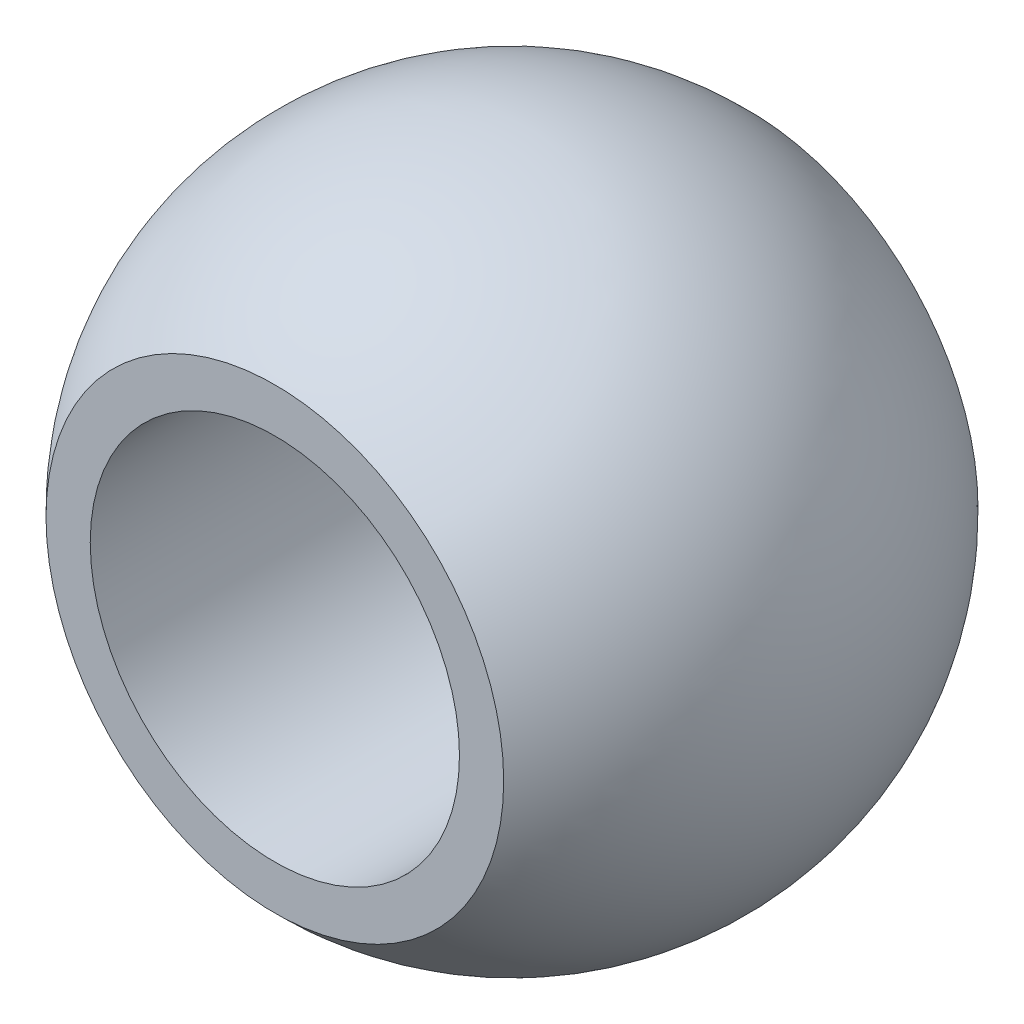
ISO-10303-21;
HEADER;
FILE_DESCRIPTION(('STEP AP214'),'2;1');
FILE_NAME('part.step','',(''),(''),'','','');
FILE_SCHEMA(('AUTOMOTIVE_DESIGN { 1 0 10303 214 1 1 1 1 }'));
ENDSEC;
DATA;
#1=APPLICATION_CONTEXT('core data for automotive mechanical design processes');
#2=APPLICATION_PROTOCOL_DEFINITION('international standard','automotive_design',2000,#1);
#3=PRODUCT_CONTEXT('',#1,'mechanical');
#4=PRODUCT('Part','Part','',(#3));
#5=PRODUCT_RELATED_PRODUCT_CATEGORY('part','',(#4));
#6=PRODUCT_DEFINITION_FORMATION('','',#4);
#7=PRODUCT_DEFINITION_CONTEXT('part definition',#1,'design');
#8=PRODUCT_DEFINITION('design','',#6,#7);
#9=PRODUCT_DEFINITION_SHAPE('','',#8);
#10=(LENGTH_UNIT() NAMED_UNIT(*) SI_UNIT(.MILLI.,.METRE.));
#11=(NAMED_UNIT(*) PLANE_ANGLE_UNIT() SI_UNIT($,.RADIAN.));
#12=(NAMED_UNIT(*) SI_UNIT($,.STERADIAN.) SOLID_ANGLE_UNIT());
#13=UNCERTAINTY_MEASURE_WITH_UNIT(LENGTH_MEASURE(1.E-05),#10,'distance_accuracy_value','');
#14=(GEOMETRIC_REPRESENTATION_CONTEXT(3) GLOBAL_UNCERTAINTY_ASSIGNED_CONTEXT((#13)) GLOBAL_UNIT_ASSIGNED_CONTEXT((#10,
#11,#12)) REPRESENTATION_CONTEXT('',''));
#15=CARTESIAN_POINT('',(0.,0.,0.));
#16=DIRECTION('',(0.,0.,1.));
#17=DIRECTION('',(1.,0.,0.));
#18=AXIS2_PLACEMENT_3D('',#15,#16,#17);
#19=CARTESIAN_POINT('',(0.,0.,-9.9187));
#20=DIRECTION('',(0.,0.,1.));
#21=DIRECTION('',(1.,0.,0.));
#22=AXIS2_PLACEMENT_3D('',#19,#20,#21);
#23=CYLINDRICAL_SURFACE('',#22,5.55625);
#24=CARTESIAN_POINT('',(0.,0.,-7.1374));
#25=DIRECTION('',(0.,0.,-1.));
#26=DIRECTION('',(-1.,0.,0.));
#27=AXIS2_PLACEMENT_3D('',#24,#25,#26);
#28=CIRCLE('',#27,5.55625);
#29=CARTESIAN_POINT('',(-5.55625,0.,-7.1374));
#30=VERTEX_POINT('',#29);
#31=EDGE_CURVE('E45',#30,#30,#28,.F.);
#32=ORIENTED_EDGE('',*,*,#31,.F.);
#33=EDGE_LOOP('',(#32));
#34=FACE_BOUND('',#33,.T.);
#35=CARTESIAN_POINT('',(0.,0.,7.1374));
#36=DIRECTION('',(0.,0.,1.));
#37=DIRECTION('',(1.,0.,0.));
#38=AXIS2_PLACEMENT_3D('',#35,#36,#37);
#39=CIRCLE('',#38,5.55625);
#40=CARTESIAN_POINT('',(5.55625,0.,7.1374));
#41=VERTEX_POINT('',#40);
#42=EDGE_CURVE('E35',#41,#41,#39,.F.);
#43=ORIENTED_EDGE('',*,*,#42,.F.);
#44=EDGE_LOOP('',(#43));
#45=FACE_BOUND('',#44,.T.);
#46=ADVANCED_FACE('F31',(#34,#45),#23,.F.);
#47=CARTESIAN_POINT('',(-19.9993358361775,-9.9187,-7.1374));
#48=DIRECTION('',(0.,0.,-1.));
#49=DIRECTION('',(-1.,0.,0.));
#50=AXIS2_PLACEMENT_3D('',#47,#48,#49);
#51=PLANE('',#50);
#52=ORIENTED_EDGE('',*,*,#31,.T.);
#53=EDGE_LOOP('',(#52));
#54=FACE_BOUND('',#53,.T.);
#55=CARTESIAN_POINT('',(0.,0.,-7.1374));
#56=DIRECTION('',(0.,0.,-1.));
#57=DIRECTION('',(-1.,0.,0.));
#58=AXIS2_PLACEMENT_3D('',#55,#56,#57);
#59=CIRCLE('',#58,6.88753445944193);
#60=CARTESIAN_POINT('',(-6.88753445944193,0.,-7.1374));
#61=VERTEX_POINT('',#60);
#62=EDGE_CURVE('E43',#61,#61,#59,.T.);
#63=ORIENTED_EDGE('',*,*,#62,.T.);
#64=EDGE_LOOP('',(#63));
#65=FACE_BOUND('',#64,.T.);
#66=ADVANCED_FACE('F52',(#54,#65),#51,.T.);
#67=CARTESIAN_POINT('',(-19.9993358361775,-9.9187,7.1374));
#68=DIRECTION('',(0.,0.,1.));
#69=DIRECTION('',(1.,0.,0.));
#70=AXIS2_PLACEMENT_3D('',#67,#68,#69);
#71=PLANE('',#70);
#72=ORIENTED_EDGE('',*,*,#42,.T.);
#73=EDGE_LOOP('',(#72));
#74=FACE_BOUND('',#73,.T.);
#75=CARTESIAN_POINT('',(0.,0.,7.1374));
#76=DIRECTION('',(0.,0.,1.));
#77=DIRECTION('',(1.,0.,0.));
#78=AXIS2_PLACEMENT_3D('',#75,#76,#77);
#79=CIRCLE('',#78,6.88753445944193);
#80=CARTESIAN_POINT('',(6.88753445944193,0.,7.1374));
#81=VERTEX_POINT('',#80);
#82=EDGE_CURVE('E11',#81,#81,#79,.T.);
#83=ORIENTED_EDGE('',*,*,#82,.T.);
#84=EDGE_LOOP('',(#83));
#85=FACE_BOUND('',#84,.T.);
#86=ADVANCED_FACE('F56',(#74,#85),#71,.T.);
#87=CARTESIAN_POINT('',(0.,0.,0.));
#88=DIRECTION('',(0.,1.,0.));
#89=DIRECTION('',(-1.,0.,0.));
#90=AXIS2_PLACEMENT_3D('',#87,#88,#89);
#91=SPHERICAL_SURFACE('',#90,9.9187);
#92=CARTESIAN_POINT('',(0.,0.,0.));
#93=DIRECTION('',(0.,0.,-1.));
#94=DIRECTION('',(-1.,0.,0.));
#95=AXIS2_PLACEMENT_3D('',#92,#93,#94);
#96=SPHERICAL_SURFACE('',#95,9.9187);
#97=ORIENTED_EDGE('',*,*,#62,.F.);
#98=EDGE_LOOP('',(#97));
#99=FACE_BOUND('',#98,.T.);
#100=ORIENTED_EDGE('',*,*,#82,.F.);
#101=EDGE_LOOP('',(#100));
#102=FACE_BOUND('',#101,.T.);
#103=ADVANCED_FACE('F33',(#99,#102),#96,.T.);
#104=CLOSED_SHELL('',(#46,#66,#86,#103));
#105=MANIFOLD_SOLID_BREP('B2',#104);
#106=ADVANCED_BREP_SHAPE_REPRESENTATION('',(#18,#105),#14);
#107=SHAPE_DEFINITION_REPRESENTATION(#9,#106);
ENDSEC;
END-ISO-10303-21;
